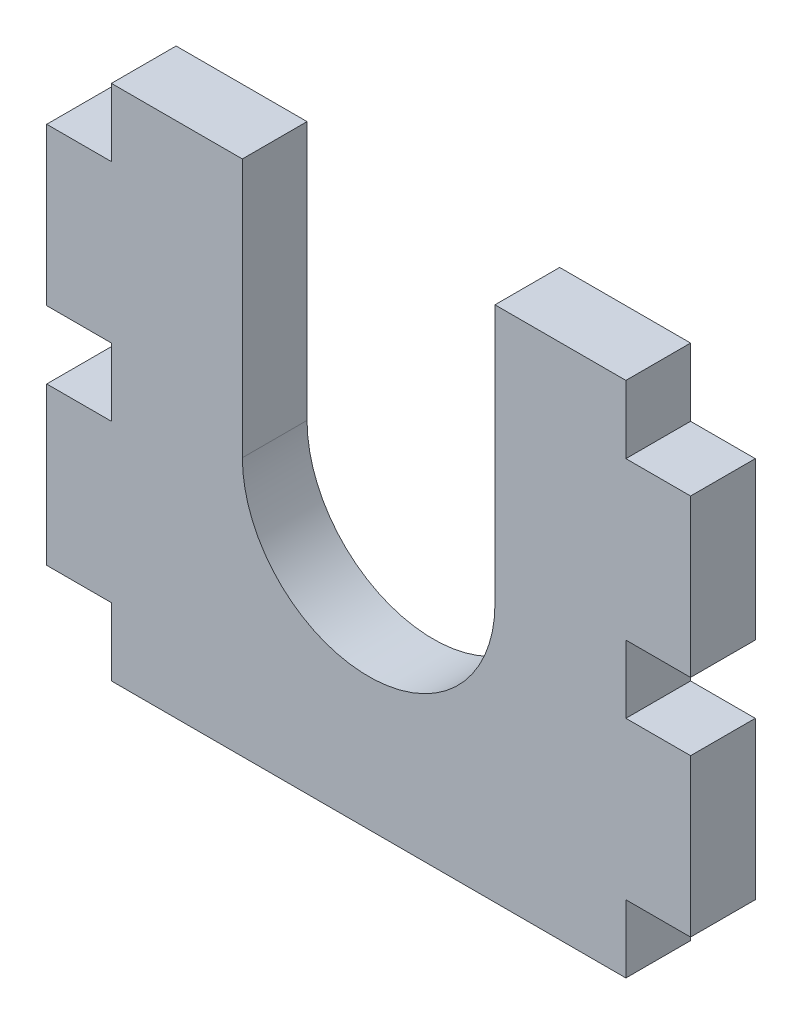
ISO-10303-21;
HEADER;
FILE_DESCRIPTION(('STEP AP214'),'2;1');
FILE_NAME('part.step','',(''),(''),'','','');
FILE_SCHEMA(('AUTOMOTIVE_DESIGN { 1 0 10303 214 1 1 1 1 }'));
ENDSEC;
DATA;
#1=APPLICATION_CONTEXT('core data for automotive mechanical design processes');
#2=APPLICATION_PROTOCOL_DEFINITION('international standard','automotive_design',2000,#1);
#3=PRODUCT_CONTEXT('',#1,'mechanical');
#4=PRODUCT('Part','Part','',(#3));
#5=PRODUCT_RELATED_PRODUCT_CATEGORY('part','',(#4));
#6=PRODUCT_DEFINITION_FORMATION('','',#4);
#7=PRODUCT_DEFINITION_CONTEXT('part definition',#1,'design');
#8=PRODUCT_DEFINITION('design','',#6,#7);
#9=PRODUCT_DEFINITION_SHAPE('','',#8);
#10=(LENGTH_UNIT() NAMED_UNIT(*) SI_UNIT(.MILLI.,.METRE.));
#11=(NAMED_UNIT(*) PLANE_ANGLE_UNIT() SI_UNIT($,.RADIAN.));
#12=(NAMED_UNIT(*) SI_UNIT($,.STERADIAN.) SOLID_ANGLE_UNIT());
#13=UNCERTAINTY_MEASURE_WITH_UNIT(LENGTH_MEASURE(1.E-05),#10,'distance_accuracy_value','');
#14=(GEOMETRIC_REPRESENTATION_CONTEXT(3) GLOBAL_UNCERTAINTY_ASSIGNED_CONTEXT((#13)) GLOBAL_UNIT_ASSIGNED_CONTEXT((#10,
#11,#12)) REPRESENTATION_CONTEXT('',''));
#15=CARTESIAN_POINT('',(0.,0.,0.));
#16=DIRECTION('',(0.,0.,1.));
#17=DIRECTION('',(1.,0.,0.));
#18=AXIS2_PLACEMENT_3D('',#15,#16,#17);
#19=CARTESIAN_POINT('',(0.,42.672,5.334));
#20=DIRECTION('',(0.,-1.,0.));
#21=DIRECTION('',(0.,0.,-1.));
#22=AXIS2_PLACEMENT_3D('',#19,#20,#21);
#23=PLANE('',#22);
#24=DIRECTION('',(-1.,0.,0.));
#25=VECTOR('',#24,1.);
#26=CARTESIAN_POINT('',(0.,42.672,0.));
#27=LINE('',#26,#25);
#28=CARTESIAN_POINT('',(47.752,42.672,0.));
#29=VERTEX_POINT('',#28);
#30=CARTESIAN_POINT('',(36.957,42.672,0.));
#31=VERTEX_POINT('',#30);
#32=EDGE_CURVE('E41',#29,#31,#27,.T.);
#33=ORIENTED_EDGE('',*,*,#32,.T.);
#34=DIRECTION('',(0.,0.,1.));
#35=VECTOR('',#34,1.);
#36=CARTESIAN_POINT('',(36.957,42.672,0.));
#37=LINE('',#36,#35);
#38=CARTESIAN_POINT('',(36.957,42.672,5.334));
#39=VERTEX_POINT('',#38);
#40=EDGE_CURVE('E344',#31,#39,#37,.T.);
#41=ORIENTED_EDGE('',*,*,#40,.T.);
#42=DIRECTION('',(-1.,0.,0.));
#43=VECTOR('',#42,1.);
#44=CARTESIAN_POINT('',(0.,42.672,5.334));
#45=LINE('',#44,#43);
#46=CARTESIAN_POINT('',(47.752,42.672,5.334));
#47=VERTEX_POINT('',#46);
#48=EDGE_CURVE('E11',#47,#39,#45,.T.);
#49=ORIENTED_EDGE('',*,*,#48,.F.);
#50=DIRECTION('',(0.,0.,1.));
#51=VECTOR('',#50,1.);
#52=CARTESIAN_POINT('',(47.752,42.672,0.));
#53=LINE('',#52,#51);
#54=EDGE_CURVE('E309',#29,#47,#53,.T.);
#55=ORIENTED_EDGE('',*,*,#54,.F.);
#56=EDGE_LOOP('',(#33,#41,#49,#55));
#57=FACE_BOUND('',#56,.T.);
#58=ADVANCED_FACE('F37',(#57),#23,.F.);
#59=CARTESIAN_POINT('',(0.,0.,5.334));
#60=DIRECTION('',(0.,1.,0.));
#61=DIRECTION('',(0.,0.,1.));
#62=AXIS2_PLACEMENT_3D('',#59,#60,#61);
#63=PLANE('',#62);
#64=DIRECTION('',(0.,0.,1.));
#65=VECTOR('',#64,1.);
#66=CARTESIAN_POINT('',(47.752,0.,0.));
#67=LINE('',#66,#65);
#68=CARTESIAN_POINT('',(47.752,0.,0.));
#69=VERTEX_POINT('',#68);
#70=CARTESIAN_POINT('',(47.752,0.,5.334));
#71=VERTEX_POINT('',#70);
#72=EDGE_CURVE('E343',#69,#71,#67,.T.);
#73=ORIENTED_EDGE('',*,*,#72,.T.);
#74=DIRECTION('',(1.,0.,0.));
#75=VECTOR('',#74,1.);
#76=CARTESIAN_POINT('',(0.,0.,5.334));
#77=LINE('',#76,#75);
#78=CARTESIAN_POINT('',(5.334,0.,5.334));
#79=VERTEX_POINT('',#78);
#80=EDGE_CURVE('E243',#79,#71,#77,.T.);
#81=ORIENTED_EDGE('',*,*,#80,.F.);
#82=DIRECTION('',(0.,0.,1.));
#83=VECTOR('',#82,1.);
#84=CARTESIAN_POINT('',(5.334,0.,0.));
#85=LINE('',#84,#83);
#86=CARTESIAN_POINT('',(5.334,0.,0.));
#87=VERTEX_POINT('',#86);
#88=EDGE_CURVE('E291',#87,#79,#85,.T.);
#89=ORIENTED_EDGE('',*,*,#88,.F.);
#90=DIRECTION('',(1.,0.,0.));
#91=VECTOR('',#90,1.);
#92=CARTESIAN_POINT('',(0.,0.,0.));
#93=LINE('',#92,#91);
#94=EDGE_CURVE('E232',#87,#69,#93,.T.);
#95=ORIENTED_EDGE('',*,*,#94,.T.);
#96=EDGE_LOOP('',(#73,#81,#89,#95));
#97=FACE_BOUND('',#96,.T.);
#98=ADVANCED_FACE('F458',(#97),#63,.F.);
#99=CARTESIAN_POINT('',(53.086,0.,5.334));
#100=DIRECTION('',(-1.,0.,0.));
#101=DIRECTION('',(0.,0.,1.));
#102=AXIS2_PLACEMENT_3D('',#99,#100,#101);
#103=PLANE('',#102);
#104=DIRECTION('',(0.,0.,1.));
#105=VECTOR('',#104,1.);
#106=CARTESIAN_POINT('',(53.086,18.542,0.));
#107=LINE('',#106,#105);
#108=CARTESIAN_POINT('',(53.086,18.542,0.));
#109=VERTEX_POINT('',#108);
#110=CARTESIAN_POINT('',(53.086,18.542,5.334));
#111=VERTEX_POINT('',#110);
#112=EDGE_CURVE('E352',#109,#111,#107,.T.);
#113=ORIENTED_EDGE('',*,*,#112,.T.);
#114=DIRECTION('',(0.,1.,0.));
#115=VECTOR('',#114,1.);
#116=CARTESIAN_POINT('',(53.086,0.,5.334));
#117=LINE('',#116,#115);
#118=CARTESIAN_POINT('',(53.086,5.588,5.334));
#119=VERTEX_POINT('',#118);
#120=EDGE_CURVE('E242',#119,#111,#117,.T.);
#121=ORIENTED_EDGE('',*,*,#120,.F.);
#122=DIRECTION('',(0.,0.,1.));
#123=VECTOR('',#122,1.);
#124=CARTESIAN_POINT('',(53.086,5.588,0.));
#125=LINE('',#124,#123);
#126=CARTESIAN_POINT('',(53.086,5.588,0.));
#127=VERTEX_POINT('',#126);
#128=EDGE_CURVE('E341',#127,#119,#125,.T.);
#129=ORIENTED_EDGE('',*,*,#128,.F.);
#130=DIRECTION('',(0.,1.,0.));
#131=VECTOR('',#130,1.);
#132=CARTESIAN_POINT('',(53.086,0.,0.));
#133=LINE('',#132,#131);
#134=EDGE_CURVE('E223',#127,#109,#133,.T.);
#135=ORIENTED_EDGE('',*,*,#134,.T.);
#136=EDGE_LOOP('',(#113,#121,#129,#135));
#137=FACE_BOUND('',#136,.T.);
#138=ADVANCED_FACE('F415',(#137),#103,.F.);
#139=CARTESIAN_POINT('',(0.,0.,5.334));
#140=DIRECTION('',(1.,0.,0.));
#141=DIRECTION('',(0.,1.,0.));
#142=AXIS2_PLACEMENT_3D('',#139,#140,#141);
#143=PLANE('',#142);
#144=DIRECTION('',(0.,0.,1.));
#145=VECTOR('',#144,1.);
#146=CARTESIAN_POINT('',(0.,24.13,0.));
#147=LINE('',#146,#145);
#148=CARTESIAN_POINT('',(0.,24.13,0.));
#149=VERTEX_POINT('',#148);
#150=CARTESIAN_POINT('',(0.,24.13,5.334));
#151=VERTEX_POINT('',#150);
#152=EDGE_CURVE('E270',#149,#151,#147,.T.);
#153=ORIENTED_EDGE('',*,*,#152,.T.);
#154=DIRECTION('',(0.,-1.,0.));
#155=VECTOR('',#154,1.);
#156=CARTESIAN_POINT('',(0.,0.,5.334));
#157=LINE('',#156,#155);
#158=CARTESIAN_POINT('',(0.,37.084,5.334));
#159=VERTEX_POINT('',#158);
#160=EDGE_CURVE('E246',#159,#151,#157,.T.);
#161=ORIENTED_EDGE('',*,*,#160,.F.);
#162=DIRECTION('',(0.,0.,1.));
#163=VECTOR('',#162,1.);
#164=CARTESIAN_POINT('',(0.,37.084,0.));
#165=LINE('',#164,#163);
#166=CARTESIAN_POINT('',(0.,37.084,0.));
#167=VERTEX_POINT('',#166);
#168=EDGE_CURVE('E253',#167,#159,#165,.T.);
#169=ORIENTED_EDGE('',*,*,#168,.F.);
#170=DIRECTION('',(0.,-1.,0.));
#171=VECTOR('',#170,1.);
#172=CARTESIAN_POINT('',(0.,0.,0.));
#173=LINE('',#172,#171);
#174=EDGE_CURVE('E236',#167,#149,#173,.T.);
#175=ORIENTED_EDGE('',*,*,#174,.T.);
#176=EDGE_LOOP('',(#153,#161,#169,#175));
#177=FACE_BOUND('',#176,.T.);
#178=ADVANCED_FACE('F427',(#177),#143,.F.);
#179=CARTESIAN_POINT('',(16.129,42.672,5.334));
#180=VERTEX_POINT('',#179);
#181=CARTESIAN_POINT('',(5.334,42.672,5.334));
#182=VERTEX_POINT('',#181);
#183=EDGE_CURVE('E46',#180,#182,#45,.T.);
#184=ORIENTED_EDGE('',*,*,#183,.F.);
#185=DIRECTION('',(0.,0.,1.));
#186=VECTOR('',#185,1.);
#187=CARTESIAN_POINT('',(16.129,42.672,0.));
#188=LINE('',#187,#186);
#189=CARTESIAN_POINT('',(16.129,42.672,0.));
#190=VERTEX_POINT('',#189);
#191=EDGE_CURVE('E203',#190,#180,#188,.T.);
#192=ORIENTED_EDGE('',*,*,#191,.F.);
#193=CARTESIAN_POINT('',(5.334,42.672,0.));
#194=VERTEX_POINT('',#193);
#195=EDGE_CURVE('E214',#190,#194,#27,.T.);
#196=ORIENTED_EDGE('',*,*,#195,.T.);
#197=DIRECTION('',(0.,0.,1.));
#198=VECTOR('',#197,1.);
#199=CARTESIAN_POINT('',(5.334,42.672,0.));
#200=LINE('',#199,#198);
#201=EDGE_CURVE('E251',#194,#182,#200,.T.);
#202=ORIENTED_EDGE('',*,*,#201,.T.);
#203=EDGE_LOOP('',(#184,#192,#196,#202));
#204=FACE_BOUND('',#203,.T.);
#205=ADVANCED_FACE('F212',(#204),#23,.F.);
#206=CARTESIAN_POINT('',(0.,18.542,0.));
#207=VERTEX_POINT('',#206);
#208=CARTESIAN_POINT('',(0.,5.588,0.));
#209=VERTEX_POINT('',#208);
#210=EDGE_CURVE('E238',#207,#209,#173,.T.);
#211=ORIENTED_EDGE('',*,*,#210,.T.);
#212=DIRECTION('',(0.,0.,1.));
#213=VECTOR('',#212,1.);
#214=CARTESIAN_POINT('',(0.,5.588,0.));
#215=LINE('',#214,#213);
#216=CARTESIAN_POINT('',(0.,5.588,5.334));
#217=VERTEX_POINT('',#216);
#218=EDGE_CURVE('E284',#209,#217,#215,.T.);
#219=ORIENTED_EDGE('',*,*,#218,.T.);
#220=CARTESIAN_POINT('',(0.,18.542,5.334));
#221=VERTEX_POINT('',#220);
#222=EDGE_CURVE('E225',#221,#217,#157,.T.);
#223=ORIENTED_EDGE('',*,*,#222,.F.);
#224=DIRECTION('',(0.,0.,1.));
#225=VECTOR('',#224,1.);
#226=CARTESIAN_POINT('',(0.,18.542,0.));
#227=LINE('',#226,#225);
#228=EDGE_CURVE('E262',#207,#221,#227,.T.);
#229=ORIENTED_EDGE('',*,*,#228,.F.);
#230=EDGE_LOOP('',(#211,#219,#223,#229));
#231=FACE_BOUND('',#230,.T.);
#232=ADVANCED_FACE('F39',(#231),#143,.F.);
#233=CARTESIAN_POINT('',(53.086,24.13,5.334));
#234=VERTEX_POINT('',#233);
#235=CARTESIAN_POINT('',(53.086,37.084,5.334));
#236=VERTEX_POINT('',#235);
#237=EDGE_CURVE('E240',#234,#236,#117,.T.);
#238=ORIENTED_EDGE('',*,*,#237,.F.);
#239=DIRECTION('',(0.,0.,1.));
#240=VECTOR('',#239,1.);
#241=CARTESIAN_POINT('',(53.086,24.13,0.));
#242=LINE('',#241,#240);
#243=CARTESIAN_POINT('',(53.086,24.13,0.));
#244=VERTEX_POINT('',#243);
#245=EDGE_CURVE('E323',#244,#234,#242,.T.);
#246=ORIENTED_EDGE('',*,*,#245,.F.);
#247=CARTESIAN_POINT('',(53.086,37.084,0.));
#248=VERTEX_POINT('',#247);
#249=EDGE_CURVE('E227',#244,#248,#133,.T.);
#250=ORIENTED_EDGE('',*,*,#249,.T.);
#251=DIRECTION('',(0.,0.,1.));
#252=VECTOR('',#251,1.);
#253=CARTESIAN_POINT('',(53.086,37.084,0.));
#254=LINE('',#253,#252);
#255=EDGE_CURVE('E304',#248,#236,#254,.T.);
#256=ORIENTED_EDGE('',*,*,#255,.T.);
#257=EDGE_LOOP('',(#238,#246,#250,#256));
#258=FACE_BOUND('',#257,.T.);
#259=ADVANCED_FACE('F401',(#258),#103,.F.);
#260=CARTESIAN_POINT('',(0.,0.,5.334));
#261=DIRECTION('',(0.,0.,-1.));
#262=DIRECTION('',(-1.,0.,0.));
#263=AXIS2_PLACEMENT_3D('',#260,#261,#262);
#264=PLANE('',#263);
#265=ORIENTED_EDGE('',*,*,#48,.T.);
#266=DIRECTION('',(0.,1.,0.));
#267=VECTOR('',#266,1.);
#268=CARTESIAN_POINT('',(36.957,21.336,5.334));
#269=LINE('',#268,#267);
#270=CARTESIAN_POINT('',(36.957,21.336,5.334));
#271=VERTEX_POINT('',#270);
#272=EDGE_CURVE('E208',#271,#39,#269,.T.);
#273=ORIENTED_EDGE('',*,*,#272,.F.);
#274=CARTESIAN_POINT('',(26.543,21.336,5.334));
#275=DIRECTION('',(0.,0.,1.));
#276=DIRECTION('',(1.,0.,0.));
#277=AXIS2_PLACEMENT_3D('',#274,#275,#276);
#278=CIRCLE('',#277,10.414);
#279=CARTESIAN_POINT('',(16.129,21.336,5.334));
#280=VERTEX_POINT('',#279);
#281=EDGE_CURVE('E375',#280,#271,#278,.T.);
#282=ORIENTED_EDGE('',*,*,#281,.F.);
#283=DIRECTION('',(0.,-1.,0.));
#284=VECTOR('',#283,1.);
#285=CARTESIAN_POINT('',(16.129,21.336,5.334));
#286=LINE('',#285,#284);
#287=EDGE_CURVE('E378',#180,#280,#286,.T.);
#288=ORIENTED_EDGE('',*,*,#287,.F.);
#289=ORIENTED_EDGE('',*,*,#183,.T.);
#290=DIRECTION('',(0.,-1.,0.));
#291=VECTOR('',#290,1.);
#292=CARTESIAN_POINT('',(5.334,42.672,5.334));
#293=LINE('',#292,#291);
#294=CARTESIAN_POINT('',(5.334,37.084,5.334));
#295=VERTEX_POINT('',#294);
#296=EDGE_CURVE('E255',#182,#295,#293,.T.);
#297=ORIENTED_EDGE('',*,*,#296,.T.);
#298=DIRECTION('',(1.,0.,0.));
#299=VECTOR('',#298,1.);
#300=CARTESIAN_POINT('',(0.,37.084,5.334));
#301=LINE('',#300,#299);
#302=EDGE_CURVE('E259',#159,#295,#301,.T.);
#303=ORIENTED_EDGE('',*,*,#302,.F.);
#304=ORIENTED_EDGE('',*,*,#160,.T.);
#305=DIRECTION('',(1.,0.,0.));
#306=VECTOR('',#305,1.);
#307=CARTESIAN_POINT('',(0.,24.13,5.334));
#308=LINE('',#307,#306);
#309=CARTESIAN_POINT('',(5.334,24.13,5.334));
#310=VERTEX_POINT('',#309);
#311=EDGE_CURVE('E274',#151,#310,#308,.T.);
#312=ORIENTED_EDGE('',*,*,#311,.T.);
#313=DIRECTION('',(0.,-1.,0.));
#314=VECTOR('',#313,1.);
#315=CARTESIAN_POINT('',(5.334,24.13,5.334));
#316=LINE('',#315,#314);
#317=CARTESIAN_POINT('',(5.334,18.542,5.334));
#318=VERTEX_POINT('',#317);
#319=EDGE_CURVE('E278',#310,#318,#316,.T.);
#320=ORIENTED_EDGE('',*,*,#319,.T.);
#321=DIRECTION('',(1.,0.,0.));
#322=VECTOR('',#321,1.);
#323=CARTESIAN_POINT('',(0.,18.542,5.334));
#324=LINE('',#323,#322);
#325=EDGE_CURVE('E281',#221,#318,#324,.T.);
#326=ORIENTED_EDGE('',*,*,#325,.F.);
#327=ORIENTED_EDGE('',*,*,#222,.T.);
#328=DIRECTION('',(-1.,0.,0.));
#329=VECTOR('',#328,1.);
#330=CARTESIAN_POINT('',(0.,5.588,5.334));
#331=LINE('',#330,#329);
#332=CARTESIAN_POINT('',(5.334,5.588,5.334));
#333=VERTEX_POINT('',#332);
#334=EDGE_CURVE('E298',#333,#217,#331,.T.);
#335=ORIENTED_EDGE('',*,*,#334,.F.);
#336=DIRECTION('',(0.,1.,0.));
#337=VECTOR('',#336,1.);
#338=CARTESIAN_POINT('',(5.334,0.,5.334));
#339=LINE('',#338,#337);
#340=EDGE_CURVE('E301',#79,#333,#339,.T.);
#341=ORIENTED_EDGE('',*,*,#340,.F.);
#342=ORIENTED_EDGE('',*,*,#80,.T.);
#343=DIRECTION('',(0.,1.,0.));
#344=VECTOR('',#343,1.);
#345=CARTESIAN_POINT('',(47.752,0.,5.334));
#346=LINE('',#345,#344);
#347=CARTESIAN_POINT('',(47.752,5.588,5.334));
#348=VERTEX_POINT('',#347);
#349=EDGE_CURVE('E331',#71,#348,#346,.T.);
#350=ORIENTED_EDGE('',*,*,#349,.T.);
#351=DIRECTION('',(-1.,0.,0.));
#352=VECTOR('',#351,1.);
#353=CARTESIAN_POINT('',(53.086,5.588,5.334));
#354=LINE('',#353,#352);
#355=EDGE_CURVE('E335',#119,#348,#354,.T.);
#356=ORIENTED_EDGE('',*,*,#355,.F.);
#357=ORIENTED_EDGE('',*,*,#120,.T.);
#358=DIRECTION('',(-1.,0.,0.));
#359=VECTOR('',#358,1.);
#360=CARTESIAN_POINT('',(53.086,18.542,5.334));
#361=LINE('',#360,#359);
#362=CARTESIAN_POINT('',(47.752,18.542,5.334));
#363=VERTEX_POINT('',#362);
#364=EDGE_CURVE('E355',#111,#363,#361,.T.);
#365=ORIENTED_EDGE('',*,*,#364,.T.);
#366=DIRECTION('',(0.,1.,0.));
#367=VECTOR('',#366,1.);
#368=CARTESIAN_POINT('',(47.752,18.542,5.334));
#369=LINE('',#368,#367);
#370=CARTESIAN_POINT('',(47.752,24.13,5.334));
#371=VERTEX_POINT('',#370);
#372=EDGE_CURVE('E359',#363,#371,#369,.T.);
#373=ORIENTED_EDGE('',*,*,#372,.T.);
#374=DIRECTION('',(-1.,0.,0.));
#375=VECTOR('',#374,1.);
#376=CARTESIAN_POINT('',(53.086,24.13,5.334));
#377=LINE('',#376,#375);
#378=EDGE_CURVE('E338',#234,#371,#377,.T.);
#379=ORIENTED_EDGE('',*,*,#378,.F.);
#380=ORIENTED_EDGE('',*,*,#237,.T.);
#381=DIRECTION('',(1.,0.,0.));
#382=VECTOR('',#381,1.);
#383=CARTESIAN_POINT('',(53.086,37.084,5.334));
#384=LINE('',#383,#382);
#385=CARTESIAN_POINT('',(47.752,37.084,5.334));
#386=VERTEX_POINT('',#385);
#387=EDGE_CURVE('E316',#386,#236,#384,.T.);
#388=ORIENTED_EDGE('',*,*,#387,.F.);
#389=DIRECTION('',(0.,-1.,0.));
#390=VECTOR('',#389,1.);
#391=CARTESIAN_POINT('',(47.752,42.672,5.334));
#392=LINE('',#391,#390);
#393=EDGE_CURVE('E320',#47,#386,#392,.T.);
#394=ORIENTED_EDGE('',*,*,#393,.F.);
#395=EDGE_LOOP('',(#265,#273,#282,#288,#289,#297,#303,#304,#312,#320,#326,#327,#335,#341,#342,
#350,#356,#357,#365,#373,#379,#380,#388,#394));
#396=FACE_BOUND('',#395,.T.);
#397=ADVANCED_FACE('F393',(#396),#264,.F.);
#398=CARTESIAN_POINT('',(0.,0.,0.));
#399=DIRECTION('',(0.,0.,-1.));
#400=DIRECTION('',(-1.,0.,0.));
#401=AXIS2_PLACEMENT_3D('',#398,#399,#400);
#402=PLANE('',#401);
#403=DIRECTION('',(0.,1.,0.));
#404=VECTOR('',#403,1.);
#405=CARTESIAN_POINT('',(36.957,21.336,0.));
#406=LINE('',#405,#404);
#407=CARTESIAN_POINT('',(36.957,21.336,0.));
#408=VERTEX_POINT('',#407);
#409=EDGE_CURVE('E216',#408,#31,#406,.T.);
#410=ORIENTED_EDGE('',*,*,#409,.T.);
#411=ORIENTED_EDGE('',*,*,#32,.F.);
#412=DIRECTION('',(0.,-1.,0.));
#413=VECTOR('',#412,1.);
#414=CARTESIAN_POINT('',(47.752,42.672,0.));
#415=LINE('',#414,#413);
#416=CARTESIAN_POINT('',(47.752,37.084,0.));
#417=VERTEX_POINT('',#416);
#418=EDGE_CURVE('E319',#29,#417,#415,.T.);
#419=ORIENTED_EDGE('',*,*,#418,.T.);
#420=DIRECTION('',(1.,0.,0.));
#421=VECTOR('',#420,1.);
#422=CARTESIAN_POINT('',(53.086,37.084,0.));
#423=LINE('',#422,#421);
#424=EDGE_CURVE('E312',#417,#248,#423,.T.);
#425=ORIENTED_EDGE('',*,*,#424,.T.);
#426=ORIENTED_EDGE('',*,*,#249,.F.);
#427=DIRECTION('',(-1.,0.,0.));
#428=VECTOR('',#427,1.);
#429=CARTESIAN_POINT('',(53.086,24.13,0.));
#430=LINE('',#429,#428);
#431=CARTESIAN_POINT('',(47.752,24.13,0.));
#432=VERTEX_POINT('',#431);
#433=EDGE_CURVE('E358',#244,#432,#430,.T.);
#434=ORIENTED_EDGE('',*,*,#433,.T.);
#435=DIRECTION('',(0.,1.,0.));
#436=VECTOR('',#435,1.);
#437=CARTESIAN_POINT('',(47.752,18.542,0.));
#438=LINE('',#437,#436);
#439=CARTESIAN_POINT('',(47.752,18.542,0.));
#440=VERTEX_POINT('',#439);
#441=EDGE_CURVE('E365',#440,#432,#438,.T.);
#442=ORIENTED_EDGE('',*,*,#441,.F.);
#443=DIRECTION('',(-1.,0.,0.));
#444=VECTOR('',#443,1.);
#445=CARTESIAN_POINT('',(53.086,18.542,0.));
#446=LINE('',#445,#444);
#447=EDGE_CURVE('E350',#109,#440,#446,.T.);
#448=ORIENTED_EDGE('',*,*,#447,.F.);
#449=ORIENTED_EDGE('',*,*,#134,.F.);
#450=DIRECTION('',(-1.,0.,0.));
#451=VECTOR('',#450,1.);
#452=CARTESIAN_POINT('',(53.086,5.588,0.));
#453=LINE('',#452,#451);
#454=CARTESIAN_POINT('',(47.752,5.588,0.));
#455=VERTEX_POINT('',#454);
#456=EDGE_CURVE('E328',#127,#455,#453,.T.);
#457=ORIENTED_EDGE('',*,*,#456,.T.);
#458=DIRECTION('',(0.,1.,0.));
#459=VECTOR('',#458,1.);
#460=CARTESIAN_POINT('',(47.752,0.,0.));
#461=LINE('',#460,#459);
#462=EDGE_CURVE('E332',#69,#455,#461,.T.);
#463=ORIENTED_EDGE('',*,*,#462,.F.);
#464=ORIENTED_EDGE('',*,*,#94,.F.);
#465=DIRECTION('',(0.,1.,0.));
#466=VECTOR('',#465,1.);
#467=CARTESIAN_POINT('',(5.334,0.,0.));
#468=LINE('',#467,#466);
#469=CARTESIAN_POINT('',(5.334,5.588,0.));
#470=VERTEX_POINT('',#469);
#471=EDGE_CURVE('E300',#87,#470,#468,.T.);
#472=ORIENTED_EDGE('',*,*,#471,.T.);
#473=DIRECTION('',(-1.,0.,0.));
#474=VECTOR('',#473,1.);
#475=CARTESIAN_POINT('',(0.,5.588,0.));
#476=LINE('',#475,#474);
#477=EDGE_CURVE('E294',#470,#209,#476,.T.);
#478=ORIENTED_EDGE('',*,*,#477,.T.);
#479=ORIENTED_EDGE('',*,*,#210,.F.);
#480=DIRECTION('',(1.,0.,0.));
#481=VECTOR('',#480,1.);
#482=CARTESIAN_POINT('',(0.,18.542,0.));
#483=LINE('',#482,#481);
#484=CARTESIAN_POINT('',(5.334,18.542,0.));
#485=VERTEX_POINT('',#484);
#486=EDGE_CURVE('E277',#207,#485,#483,.T.);
#487=ORIENTED_EDGE('',*,*,#486,.T.);
#488=DIRECTION('',(0.,-1.,0.));
#489=VECTOR('',#488,1.);
#490=CARTESIAN_POINT('',(5.334,24.13,0.));
#491=LINE('',#490,#489);
#492=CARTESIAN_POINT('',(5.334,24.13,0.));
#493=VERTEX_POINT('',#492);
#494=EDGE_CURVE('E287',#493,#485,#491,.T.);
#495=ORIENTED_EDGE('',*,*,#494,.F.);
#496=DIRECTION('',(1.,0.,0.));
#497=VECTOR('',#496,1.);
#498=CARTESIAN_POINT('',(0.,24.13,0.));
#499=LINE('',#498,#497);
#500=EDGE_CURVE('E268',#149,#493,#499,.T.);
#501=ORIENTED_EDGE('',*,*,#500,.F.);
#502=ORIENTED_EDGE('',*,*,#174,.F.);
#503=DIRECTION('',(1.,0.,0.));
#504=VECTOR('',#503,1.);
#505=CARTESIAN_POINT('',(0.,37.084,0.));
#506=LINE('',#505,#504);
#507=CARTESIAN_POINT('',(5.334,37.084,0.));
#508=VERTEX_POINT('',#507);
#509=EDGE_CURVE('E258',#167,#508,#506,.T.);
#510=ORIENTED_EDGE('',*,*,#509,.T.);
#511=DIRECTION('',(0.,-1.,0.));
#512=VECTOR('',#511,1.);
#513=CARTESIAN_POINT('',(5.334,42.672,0.));
#514=LINE('',#513,#512);
#515=EDGE_CURVE('E222',#194,#508,#514,.T.);
#516=ORIENTED_EDGE('',*,*,#515,.F.);
#517=ORIENTED_EDGE('',*,*,#195,.F.);
#518=DIRECTION('',(0.,-1.,0.));
#519=VECTOR('',#518,1.);
#520=CARTESIAN_POINT('',(16.129,21.336,0.));
#521=LINE('',#520,#519);
#522=CARTESIAN_POINT('',(16.129,21.336,0.));
#523=VERTEX_POINT('',#522);
#524=EDGE_CURVE('E199',#190,#523,#521,.T.);
#525=ORIENTED_EDGE('',*,*,#524,.T.);
#526=CARTESIAN_POINT('',(26.543,21.336,0.));
#527=DIRECTION('',(0.,0.,1.));
#528=DIRECTION('',(1.,0.,0.));
#529=AXIS2_PLACEMENT_3D('',#526,#527,#528);
#530=CIRCLE('',#529,10.414);
#531=EDGE_CURVE('E54',#523,#408,#530,.T.);
#532=ORIENTED_EDGE('',*,*,#531,.T.);
#533=EDGE_LOOP('',(#410,#411,#419,#425,#426,#434,#442,#448,#449,#457,#463,#464,#472,#478,#479,
#487,#495,#501,#502,#510,#516,#517,#525,#532));
#534=FACE_BOUND('',#533,.T.);
#535=ADVANCED_FACE('F220',(#534),#402,.T.);
#536=CARTESIAN_POINT('',(0.,37.084,0.));
#537=DIRECTION('',(0.,-1.,0.));
#538=DIRECTION('',(0.,0.,-1.));
#539=AXIS2_PLACEMENT_3D('',#536,#537,#538);
#540=PLANE('',#539);
#541=ORIENTED_EDGE('',*,*,#302,.T.);
#542=DIRECTION('',(0.,0.,1.));
#543=VECTOR('',#542,1.);
#544=CARTESIAN_POINT('',(5.334,37.084,0.));
#545=LINE('',#544,#543);
#546=EDGE_CURVE('E249',#508,#295,#545,.T.);
#547=ORIENTED_EDGE('',*,*,#546,.F.);
#548=ORIENTED_EDGE('',*,*,#509,.F.);
#549=ORIENTED_EDGE('',*,*,#168,.T.);
#550=EDGE_LOOP('',(#541,#547,#548,#549));
#551=FACE_BOUND('',#550,.T.);
#552=ADVANCED_FACE('F423',(#551),#540,.F.);
#553=CARTESIAN_POINT('',(5.334,42.672,0.));
#554=DIRECTION('',(-1.,0.,0.));
#555=DIRECTION('',(0.,-1.,0.));
#556=AXIS2_PLACEMENT_3D('',#553,#554,#555);
#557=PLANE('',#556);
#558=ORIENTED_EDGE('',*,*,#296,.F.);
#559=ORIENTED_EDGE('',*,*,#201,.F.);
#560=ORIENTED_EDGE('',*,*,#515,.T.);
#561=ORIENTED_EDGE('',*,*,#546,.T.);
#562=EDGE_LOOP('',(#558,#559,#560,#561));
#563=FACE_BOUND('',#562,.T.);
#564=ADVANCED_FACE('F420',(#563),#557,.T.);
#565=CARTESIAN_POINT('',(0.,18.542,0.));
#566=DIRECTION('',(0.,-1.,0.));
#567=DIRECTION('',(0.,0.,-1.));
#568=AXIS2_PLACEMENT_3D('',#565,#566,#567);
#569=PLANE('',#568);
#570=ORIENTED_EDGE('',*,*,#325,.T.);
#571=DIRECTION('',(0.,0.,1.));
#572=VECTOR('',#571,1.);
#573=CARTESIAN_POINT('',(5.334,18.542,0.));
#574=LINE('',#573,#572);
#575=EDGE_CURVE('E265',#485,#318,#574,.T.);
#576=ORIENTED_EDGE('',*,*,#575,.F.);
#577=ORIENTED_EDGE('',*,*,#486,.F.);
#578=ORIENTED_EDGE('',*,*,#228,.T.);
#579=EDGE_LOOP('',(#570,#576,#577,#578));
#580=FACE_BOUND('',#579,.T.);
#581=ADVANCED_FACE('F439',(#580),#569,.F.);
#582=CARTESIAN_POINT('',(0.,24.13,0.));
#583=DIRECTION('',(0.,-1.,0.));
#584=DIRECTION('',(0.,0.,-1.));
#585=AXIS2_PLACEMENT_3D('',#582,#583,#584);
#586=PLANE('',#585);
#587=ORIENTED_EDGE('',*,*,#311,.F.);
#588=ORIENTED_EDGE('',*,*,#152,.F.);
#589=ORIENTED_EDGE('',*,*,#500,.T.);
#590=DIRECTION('',(0.,0.,1.));
#591=VECTOR('',#590,1.);
#592=CARTESIAN_POINT('',(5.334,24.13,0.));
#593=LINE('',#592,#591);
#594=EDGE_CURVE('E267',#493,#310,#593,.T.);
#595=ORIENTED_EDGE('',*,*,#594,.T.);
#596=EDGE_LOOP('',(#587,#588,#589,#595));
#597=FACE_BOUND('',#596,.T.);
#598=ADVANCED_FACE('F431',(#597),#586,.T.);
#599=CARTESIAN_POINT('',(5.334,24.13,0.));
#600=DIRECTION('',(-1.,0.,0.));
#601=DIRECTION('',(0.,-1.,0.));
#602=AXIS2_PLACEMENT_3D('',#599,#600,#601);
#603=PLANE('',#602);
#604=ORIENTED_EDGE('',*,*,#319,.F.);
#605=ORIENTED_EDGE('',*,*,#594,.F.);
#606=ORIENTED_EDGE('',*,*,#494,.T.);
#607=ORIENTED_EDGE('',*,*,#575,.T.);
#608=EDGE_LOOP('',(#604,#605,#606,#607));
#609=FACE_BOUND('',#608,.T.);
#610=ADVANCED_FACE('F437',(#609),#603,.T.);
#611=CARTESIAN_POINT('',(0.,5.588,0.));
#612=DIRECTION('',(0.,1.,0.));
#613=DIRECTION('',(0.,0.,1.));
#614=AXIS2_PLACEMENT_3D('',#611,#612,#613);
#615=PLANE('',#614);
#616=ORIENTED_EDGE('',*,*,#334,.T.);
#617=ORIENTED_EDGE('',*,*,#218,.F.);
#618=ORIENTED_EDGE('',*,*,#477,.F.);
#619=DIRECTION('',(0.,0.,1.));
#620=VECTOR('',#619,1.);
#621=CARTESIAN_POINT('',(5.334,5.588,0.));
#622=LINE('',#621,#620);
#623=EDGE_CURVE('E293',#470,#333,#622,.T.);
#624=ORIENTED_EDGE('',*,*,#623,.T.);
#625=EDGE_LOOP('',(#616,#617,#618,#624));
#626=FACE_BOUND('',#625,.T.);
#627=ADVANCED_FACE('F448',(#626),#615,.F.);
#628=CARTESIAN_POINT('',(5.334,0.,0.));
#629=DIRECTION('',(1.,0.,0.));
#630=DIRECTION('',(0.,1.,0.));
#631=AXIS2_PLACEMENT_3D('',#628,#629,#630);
#632=PLANE('',#631);
#633=ORIENTED_EDGE('',*,*,#340,.T.);
#634=ORIENTED_EDGE('',*,*,#623,.F.);
#635=ORIENTED_EDGE('',*,*,#471,.F.);
#636=ORIENTED_EDGE('',*,*,#88,.T.);
#637=EDGE_LOOP('',(#633,#634,#635,#636));
#638=FACE_BOUND('',#637,.T.);
#639=ADVANCED_FACE('F454',(#638),#632,.F.);
#640=CARTESIAN_POINT('',(53.086,37.084,0.));
#641=DIRECTION('',(0.,-1.,0.));
#642=DIRECTION('',(0.,0.,-1.));
#643=AXIS2_PLACEMENT_3D('',#640,#641,#642);
#644=PLANE('',#643);
#645=ORIENTED_EDGE('',*,*,#387,.T.);
#646=ORIENTED_EDGE('',*,*,#255,.F.);
#647=ORIENTED_EDGE('',*,*,#424,.F.);
#648=DIRECTION('',(0.,0.,1.));
#649=VECTOR('',#648,1.);
#650=CARTESIAN_POINT('',(47.752,37.084,0.));
#651=LINE('',#650,#649);
#652=EDGE_CURVE('E311',#417,#386,#651,.T.);
#653=ORIENTED_EDGE('',*,*,#652,.T.);
#654=EDGE_LOOP('',(#645,#646,#647,#653));
#655=FACE_BOUND('',#654,.T.);
#656=ADVANCED_FACE('F399',(#655),#644,.F.);
#657=CARTESIAN_POINT('',(47.752,42.672,0.));
#658=DIRECTION('',(-1.,0.,0.));
#659=DIRECTION('',(0.,0.,1.));
#660=AXIS2_PLACEMENT_3D('',#657,#658,#659);
#661=PLANE('',#660);
#662=ORIENTED_EDGE('',*,*,#393,.T.);
#663=ORIENTED_EDGE('',*,*,#652,.F.);
#664=ORIENTED_EDGE('',*,*,#418,.F.);
#665=ORIENTED_EDGE('',*,*,#54,.T.);
#666=EDGE_LOOP('',(#662,#663,#664,#665));
#667=FACE_BOUND('',#666,.T.);
#668=ADVANCED_FACE('F389',(#667),#661,.F.);
#669=CARTESIAN_POINT('',(53.086,5.588,0.));
#670=DIRECTION('',(0.,1.,0.));
#671=DIRECTION('',(0.,0.,1.));
#672=AXIS2_PLACEMENT_3D('',#669,#670,#671);
#673=PLANE('',#672);
#674=ORIENTED_EDGE('',*,*,#355,.T.);
#675=DIRECTION('',(0.,0.,1.));
#676=VECTOR('',#675,1.);
#677=CARTESIAN_POINT('',(47.752,5.588,0.));
#678=LINE('',#677,#676);
#679=EDGE_CURVE('E334',#455,#348,#678,.T.);
#680=ORIENTED_EDGE('',*,*,#679,.F.);
#681=ORIENTED_EDGE('',*,*,#456,.F.);
#682=ORIENTED_EDGE('',*,*,#128,.T.);
#683=EDGE_LOOP('',(#674,#680,#681,#682));
#684=FACE_BOUND('',#683,.T.);
#685=ADVANCED_FACE('F463',(#684),#673,.F.);
#686=CARTESIAN_POINT('',(47.752,0.,0.));
#687=DIRECTION('',(1.,0.,0.));
#688=DIRECTION('',(0.,0.,-1.));
#689=AXIS2_PLACEMENT_3D('',#686,#687,#688);
#690=PLANE('',#689);
#691=ORIENTED_EDGE('',*,*,#349,.F.);
#692=ORIENTED_EDGE('',*,*,#72,.F.);
#693=ORIENTED_EDGE('',*,*,#462,.T.);
#694=ORIENTED_EDGE('',*,*,#679,.T.);
#695=EDGE_LOOP('',(#691,#692,#693,#694));
#696=FACE_BOUND('',#695,.T.);
#697=ADVANCED_FACE('F460',(#696),#690,.T.);
#698=CARTESIAN_POINT('',(53.086,24.13,0.));
#699=DIRECTION('',(0.,1.,0.));
#700=DIRECTION('',(0.,0.,1.));
#701=AXIS2_PLACEMENT_3D('',#698,#699,#700);
#702=PLANE('',#701);
#703=ORIENTED_EDGE('',*,*,#378,.T.);
#704=DIRECTION('',(0.,0.,1.));
#705=VECTOR('',#704,1.);
#706=CARTESIAN_POINT('',(47.752,24.13,0.));
#707=LINE('',#706,#705);
#708=EDGE_CURVE('E348',#432,#371,#707,.T.);
#709=ORIENTED_EDGE('',*,*,#708,.F.);
#710=ORIENTED_EDGE('',*,*,#433,.F.);
#711=ORIENTED_EDGE('',*,*,#245,.T.);
#712=EDGE_LOOP('',(#703,#709,#710,#711));
#713=FACE_BOUND('',#712,.T.);
#714=ADVANCED_FACE('F408',(#713),#702,.F.);
#715=CARTESIAN_POINT('',(53.086,18.542,0.));
#716=DIRECTION('',(0.,1.,0.));
#717=DIRECTION('',(0.,0.,1.));
#718=AXIS2_PLACEMENT_3D('',#715,#716,#717);
#719=PLANE('',#718);
#720=ORIENTED_EDGE('',*,*,#364,.F.);
#721=ORIENTED_EDGE('',*,*,#112,.F.);
#722=ORIENTED_EDGE('',*,*,#447,.T.);
#723=DIRECTION('',(0.,0.,1.));
#724=VECTOR('',#723,1.);
#725=CARTESIAN_POINT('',(47.752,18.542,0.));
#726=LINE('',#725,#724);
#727=EDGE_CURVE('E62',#440,#363,#726,.T.);
#728=ORIENTED_EDGE('',*,*,#727,.T.);
#729=EDGE_LOOP('',(#720,#721,#722,#728));
#730=FACE_BOUND('',#729,.T.);
#731=ADVANCED_FACE('F414',(#730),#719,.T.);
#732=CARTESIAN_POINT('',(47.752,18.542,0.));
#733=DIRECTION('',(1.,0.,0.));
#734=DIRECTION('',(0.,0.,-1.));
#735=AXIS2_PLACEMENT_3D('',#732,#733,#734);
#736=PLANE('',#735);
#737=ORIENTED_EDGE('',*,*,#372,.F.);
#738=ORIENTED_EDGE('',*,*,#727,.F.);
#739=ORIENTED_EDGE('',*,*,#441,.T.);
#740=ORIENTED_EDGE('',*,*,#708,.T.);
#741=EDGE_LOOP('',(#737,#738,#739,#740));
#742=FACE_BOUND('',#741,.T.);
#743=ADVANCED_FACE('F409',(#742),#736,.T.);
#744=CARTESIAN_POINT('',(36.957,21.336,0.));
#745=DIRECTION('',(1.,0.,0.));
#746=DIRECTION('',(0.,0.,-1.));
#747=AXIS2_PLACEMENT_3D('',#744,#745,#746);
#748=PLANE('',#747);
#749=ORIENTED_EDGE('',*,*,#272,.T.);
#750=ORIENTED_EDGE('',*,*,#40,.F.);
#751=ORIENTED_EDGE('',*,*,#409,.F.);
#752=DIRECTION('',(0.,0.,1.));
#753=VECTOR('',#752,1.);
#754=CARTESIAN_POINT('',(36.957,21.336,0.));
#755=LINE('',#754,#753);
#756=EDGE_CURVE('E370',#408,#271,#755,.T.);
#757=ORIENTED_EDGE('',*,*,#756,.T.);
#758=EDGE_LOOP('',(#749,#750,#751,#757));
#759=FACE_BOUND('',#758,.T.);
#760=ADVANCED_FACE('F577',(#759),#748,.F.);
#761=CARTESIAN_POINT('',(26.543,21.336,0.));
#762=DIRECTION('',(0.,0.,1.));
#763=DIRECTION('',(1.,0.,0.));
#764=AXIS2_PLACEMENT_3D('',#761,#762,#763);
#765=CYLINDRICAL_SURFACE('',#764,10.414);
#766=ORIENTED_EDGE('',*,*,#281,.T.);
#767=ORIENTED_EDGE('',*,*,#756,.F.);
#768=ORIENTED_EDGE('',*,*,#531,.F.);
#769=DIRECTION('',(0.,0.,1.));
#770=VECTOR('',#769,1.);
#771=CARTESIAN_POINT('',(16.129,21.336,0.));
#772=LINE('',#771,#770);
#773=EDGE_CURVE('E205',#523,#280,#772,.T.);
#774=ORIENTED_EDGE('',*,*,#773,.T.);
#775=EDGE_LOOP('',(#766,#767,#768,#774));
#776=FACE_BOUND('',#775,.T.);
#777=ADVANCED_FACE('F609',(#776),#765,.F.);
#778=CARTESIAN_POINT('',(16.129,21.336,0.));
#779=DIRECTION('',(-1.,0.,0.));
#780=DIRECTION('',(0.,0.,1.));
#781=AXIS2_PLACEMENT_3D('',#778,#779,#780);
#782=PLANE('',#781);
#783=ORIENTED_EDGE('',*,*,#287,.T.);
#784=ORIENTED_EDGE('',*,*,#773,.F.);
#785=ORIENTED_EDGE('',*,*,#524,.F.);
#786=ORIENTED_EDGE('',*,*,#191,.T.);
#787=EDGE_LOOP('',(#783,#784,#785,#786));
#788=FACE_BOUND('',#787,.T.);
#789=ADVANCED_FACE('F202',(#788),#782,.F.);
#790=CLOSED_SHELL('',(#58,#98,#138,#178,#205,#232,#259,#397,#535,#552,#564,#581,#598,#610,#627,
#639,#656,#668,#685,#697,#714,#731,#743,#760,#777,#789));
#791=MANIFOLD_SOLID_BREP('B2',#790);
#792=ADVANCED_BREP_SHAPE_REPRESENTATION('',(#18,#791),#14);
#793=SHAPE_DEFINITION_REPRESENTATION(#9,#792);
ENDSEC;
END-ISO-10303-21;
